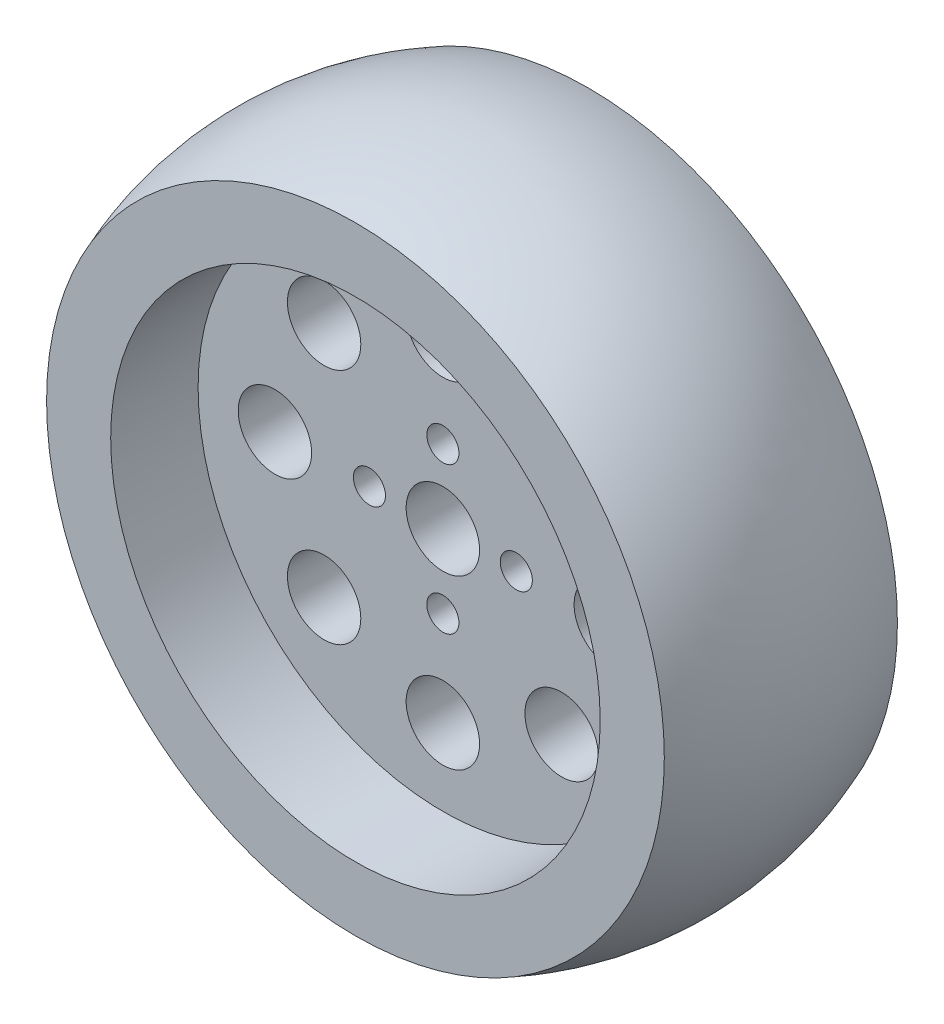
ISO-10303-21;
HEADER;
FILE_DESCRIPTION(('STEP AP214'),'2;1');
FILE_NAME('part.step','',(''),(''),'','','');
FILE_SCHEMA(('AUTOMOTIVE_DESIGN { 1 0 10303 214 1 1 1 1 }'));
ENDSEC;
DATA;
#1=APPLICATION_CONTEXT('core data for automotive mechanical design processes');
#2=APPLICATION_PROTOCOL_DEFINITION('international standard','automotive_design',2000,#1);
#3=PRODUCT_CONTEXT('',#1,'mechanical');
#4=PRODUCT('Part','Part','',(#3));
#5=PRODUCT_RELATED_PRODUCT_CATEGORY('part','',(#4));
#6=PRODUCT_DEFINITION_FORMATION('','',#4);
#7=PRODUCT_DEFINITION_CONTEXT('part definition',#1,'design');
#8=PRODUCT_DEFINITION('design','',#6,#7);
#9=PRODUCT_DEFINITION_SHAPE('','',#8);
#10=(LENGTH_UNIT() NAMED_UNIT(*) SI_UNIT(.MILLI.,.METRE.));
#11=(NAMED_UNIT(*) PLANE_ANGLE_UNIT() SI_UNIT($,.RADIAN.));
#12=(NAMED_UNIT(*) SI_UNIT($,.STERADIAN.) SOLID_ANGLE_UNIT());
#13=UNCERTAINTY_MEASURE_WITH_UNIT(LENGTH_MEASURE(1.E-05),#10,'distance_accuracy_value','');
#14=(GEOMETRIC_REPRESENTATION_CONTEXT(3) GLOBAL_UNCERTAINTY_ASSIGNED_CONTEXT((#13)) GLOBAL_UNIT_ASSIGNED_CONTEXT((#10,
#11,#12)) REPRESENTATION_CONTEXT('',''));
#15=CARTESIAN_POINT('',(0.,0.,0.));
#16=DIRECTION('',(0.,0.,1.));
#17=DIRECTION('',(1.,0.,0.));
#18=AXIS2_PLACEMENT_3D('',#15,#16,#17);
#19=CARTESIAN_POINT('',(0.,0.,2.159));
#20=DIRECTION('',(0.,0.,1.));
#21=DIRECTION('',(1.,0.,0.));
#22=AXIS2_PLACEMENT_3D('',#19,#20,#21);
#23=PLANE('',#22);
#24=CARTESIAN_POINT('',(0.,0.,2.159));
#25=DIRECTION('',(0.,0.,1.));
#26=DIRECTION('',(1.,0.,0.));
#27=AXIS2_PLACEMENT_3D('',#24,#25,#26);
#28=CIRCLE('',#27,26.67);
#29=CARTESIAN_POINT('',(26.67,0.,2.159));
#30=VERTEX_POINT('',#29);
#31=EDGE_CURVE('E41',#30,#30,#28,.T.);
#32=ORIENTED_EDGE('',*,*,#31,.F.);
#33=EDGE_LOOP('',(#32));
#34=FACE_BOUND('',#33,.T.);
#35=CARTESIAN_POINT('',(0.,0.,2.159));
#36=DIRECTION('',(0.,0.,-1.));
#37=DIRECTION('',(-1.,0.,0.));
#38=AXIS2_PLACEMENT_3D('',#35,#36,#37);
#39=CIRCLE('',#38,33.655);
#40=CARTESIAN_POINT('',(-33.655,0.,2.159));
#41=VERTEX_POINT('',#40);
#42=EDGE_CURVE('E48',#41,#41,#39,.T.);
#43=ORIENTED_EDGE('',*,*,#42,.F.);
#44=EDGE_LOOP('',(#43));
#45=FACE_BOUND('',#44,.T.);
#46=ADVANCED_FACE('F28',(#34,#45),#23,.T.);
#47=CARTESIAN_POINT('',(0.,0.,-7.366));
#48=DIRECTION('',(0.,0.,1.));
#49=DIRECTION('',(1.,0.,0.));
#50=AXIS2_PLACEMENT_3D('',#47,#48,#49);
#51=PLANE('',#50);
#52=CARTESIAN_POINT('',(-12.9400540957138,12.9400540957138,-7.366));
#53=DIRECTION('',(0.,0.,1.));
#54=DIRECTION('',(1.,0.,0.));
#55=AXIS2_PLACEMENT_3D('',#52,#53,#54);
#56=CIRCLE('',#55,4.);
#57=CARTESIAN_POINT('',(-8.94005409571382,12.9400540957138,-7.366));
#58=VERTEX_POINT('',#57);
#59=EDGE_CURVE('E101',#58,#58,#56,.T.);
#60=ORIENTED_EDGE('',*,*,#59,.F.);
#61=EDGE_LOOP('',(#60));
#62=FACE_BOUND('',#61,.T.);
#63=CARTESIAN_POINT('',(-12.9400540957138,-12.9400540957138,-7.366));
#64=DIRECTION('',(0.,0.,1.));
#65=DIRECTION('',(1.,0.,0.));
#66=AXIS2_PLACEMENT_3D('',#63,#64,#65);
#67=CIRCLE('',#66,4.);
#68=CARTESIAN_POINT('',(-8.94005409571382,-12.9400540957138,-7.366));
#69=VERTEX_POINT('',#68);
#70=EDGE_CURVE('E91',#69,#69,#67,.T.);
#71=ORIENTED_EDGE('',*,*,#70,.F.);
#72=EDGE_LOOP('',(#71));
#73=FACE_BOUND('',#72,.T.);
#74=CARTESIAN_POINT('',(12.9400540957138,-12.9400540957138,-7.366));
#75=DIRECTION('',(0.,0.,1.));
#76=DIRECTION('',(1.,0.,0.));
#77=AXIS2_PLACEMENT_3D('',#74,#75,#76);
#78=CIRCLE('',#77,4.);
#79=CARTESIAN_POINT('',(16.9400540957138,-12.9400540957138,-7.366));
#80=VERTEX_POINT('',#79);
#81=EDGE_CURVE('E88',#80,#80,#78,.T.);
#82=ORIENTED_EDGE('',*,*,#81,.F.);
#83=EDGE_LOOP('',(#82));
#84=FACE_BOUND('',#83,.T.);
#85=CARTESIAN_POINT('',(12.9400540957138,12.9400540957138,-7.366));
#86=DIRECTION('',(0.,0.,1.));
#87=DIRECTION('',(1.,0.,0.));
#88=AXIS2_PLACEMENT_3D('',#85,#86,#87);
#89=CIRCLE('',#88,4.);
#90=CARTESIAN_POINT('',(16.9400540957138,12.9400540957138,-7.366));
#91=VERTEX_POINT('',#90);
#92=EDGE_CURVE('E85',#91,#91,#89,.T.);
#93=ORIENTED_EDGE('',*,*,#92,.F.);
#94=EDGE_LOOP('',(#93));
#95=FACE_BOUND('',#94,.T.);
#96=CARTESIAN_POINT('',(-18.3,0.,-7.366));
#97=DIRECTION('',(0.,0.,1.));
#98=DIRECTION('',(1.,0.,0.));
#99=AXIS2_PLACEMENT_3D('',#96,#97,#98);
#100=CIRCLE('',#99,4.);
#101=CARTESIAN_POINT('',(-14.3,0.,-7.366));
#102=VERTEX_POINT('',#101);
#103=EDGE_CURVE('E81',#102,#102,#100,.T.);
#104=ORIENTED_EDGE('',*,*,#103,.F.);
#105=EDGE_LOOP('',(#104));
#106=FACE_BOUND('',#105,.T.);
#107=CARTESIAN_POINT('',(0.,-18.3,-7.366));
#108=DIRECTION('',(0.,0.,1.));
#109=DIRECTION('',(1.,0.,0.));
#110=AXIS2_PLACEMENT_3D('',#107,#108,#109);
#111=CIRCLE('',#110,4.);
#112=CARTESIAN_POINT('',(4.,-18.3,-7.366));
#113=VERTEX_POINT('',#112);
#114=EDGE_CURVE('E77',#113,#113,#111,.T.);
#115=ORIENTED_EDGE('',*,*,#114,.F.);
#116=EDGE_LOOP('',(#115));
#117=FACE_BOUND('',#116,.T.);
#118=CARTESIAN_POINT('',(18.3,0.,-7.366));
#119=DIRECTION('',(0.,0.,1.));
#120=DIRECTION('',(1.,0.,0.));
#121=AXIS2_PLACEMENT_3D('',#118,#119,#120);
#122=CIRCLE('',#121,4.);
#123=CARTESIAN_POINT('',(22.3,0.,-7.366));
#124=VERTEX_POINT('',#123);
#125=EDGE_CURVE('E73',#124,#124,#122,.T.);
#126=ORIENTED_EDGE('',*,*,#125,.F.);
#127=EDGE_LOOP('',(#126));
#128=FACE_BOUND('',#127,.T.);
#129=CARTESIAN_POINT('',(0.,18.3,-7.366));
#130=DIRECTION('',(0.,0.,1.));
#131=DIRECTION('',(1.,0.,0.));
#132=AXIS2_PLACEMENT_3D('',#129,#130,#131);
#133=CIRCLE('',#132,4.);
#134=CARTESIAN_POINT('',(4.,18.3,-7.366));
#135=VERTEX_POINT('',#134);
#136=EDGE_CURVE('E69',#135,#135,#133,.T.);
#137=ORIENTED_EDGE('',*,*,#136,.F.);
#138=EDGE_LOOP('',(#137));
#139=FACE_BOUND('',#138,.T.);
#140=CARTESIAN_POINT('',(-8.,0.,-7.366));
#141=DIRECTION('',(0.,0.,1.));
#142=DIRECTION('',(1.,0.,0.));
#143=AXIS2_PLACEMENT_3D('',#140,#141,#142);
#144=CIRCLE('',#143,1.75);
#145=CARTESIAN_POINT('',(-6.25,0.,-7.366));
#146=VERTEX_POINT('',#145);
#147=EDGE_CURVE('E65',#146,#146,#144,.T.);
#148=ORIENTED_EDGE('',*,*,#147,.F.);
#149=EDGE_LOOP('',(#148));
#150=FACE_BOUND('',#149,.T.);
#151=CARTESIAN_POINT('',(0.,-8.,-7.366));
#152=DIRECTION('',(0.,0.,1.));
#153=DIRECTION('',(1.,0.,0.));
#154=AXIS2_PLACEMENT_3D('',#151,#152,#153);
#155=CIRCLE('',#154,1.75);
#156=CARTESIAN_POINT('',(1.75,-8.,-7.366));
#157=VERTEX_POINT('',#156);
#158=EDGE_CURVE('E61',#157,#157,#155,.T.);
#159=ORIENTED_EDGE('',*,*,#158,.F.);
#160=EDGE_LOOP('',(#159));
#161=FACE_BOUND('',#160,.T.);
#162=CARTESIAN_POINT('',(8.,0.,-7.366));
#163=DIRECTION('',(0.,0.,1.));
#164=DIRECTION('',(1.,0.,0.));
#165=AXIS2_PLACEMENT_3D('',#162,#163,#164);
#166=CIRCLE('',#165,1.75);
#167=CARTESIAN_POINT('',(9.75,0.,-7.366));
#168=VERTEX_POINT('',#167);
#169=EDGE_CURVE('E57',#168,#168,#166,.T.);
#170=ORIENTED_EDGE('',*,*,#169,.F.);
#171=EDGE_LOOP('',(#170));
#172=FACE_BOUND('',#171,.T.);
#173=CARTESIAN_POINT('',(0.,8.,-7.366));
#174=DIRECTION('',(0.,0.,1.));
#175=DIRECTION('',(1.,0.,0.));
#176=AXIS2_PLACEMENT_3D('',#173,#174,#175);
#177=CIRCLE('',#176,1.75);
#178=CARTESIAN_POINT('',(1.75,8.,-7.366));
#179=VERTEX_POINT('',#178);
#180=EDGE_CURVE('E53',#179,#179,#177,.T.);
#181=ORIENTED_EDGE('',*,*,#180,.F.);
#182=EDGE_LOOP('',(#181));
#183=FACE_BOUND('',#182,.T.);
#184=CARTESIAN_POINT('',(0.,0.,-7.366));
#185=DIRECTION('',(0.,0.,1.));
#186=DIRECTION('',(1.,0.,0.));
#187=AXIS2_PLACEMENT_3D('',#184,#185,#186);
#188=CIRCLE('',#187,4.);
#189=CARTESIAN_POINT('',(4.,0.,-7.366));
#190=VERTEX_POINT('',#189);
#191=EDGE_CURVE('E49',#190,#190,#188,.T.);
#192=ORIENTED_EDGE('',*,*,#191,.F.);
#193=EDGE_LOOP('',(#192));
#194=FACE_BOUND('',#193,.T.);
#195=CARTESIAN_POINT('',(0.,0.,-7.366));
#196=DIRECTION('',(0.,0.,1.));
#197=DIRECTION('',(1.,0.,0.));
#198=AXIS2_PLACEMENT_3D('',#195,#196,#197);
#199=CIRCLE('',#198,26.67);
#200=CARTESIAN_POINT('',(26.67,0.,-7.366));
#201=VERTEX_POINT('',#200);
#202=EDGE_CURVE('E10',#201,#201,#199,.T.);
#203=ORIENTED_EDGE('',*,*,#202,.T.);
#204=EDGE_LOOP('',(#203));
#205=FACE_BOUND('',#204,.T.);
#206=ADVANCED_FACE('F137',(#62,#73,#84,#95,#106,#117,#128,#139,#150,#161,#172,#183,#194,#205),
#51,.T.);
#207=CARTESIAN_POINT('',(0.,0.,-7.366));
#208=DIRECTION('',(0.,0.,1.));
#209=DIRECTION('',(1.,0.,0.));
#210=AXIS2_PLACEMENT_3D('',#207,#208,#209);
#211=CYLINDRICAL_SURFACE('',#210,26.67);
#212=ORIENTED_EDGE('',*,*,#202,.F.);
#213=EDGE_LOOP('',(#212));
#214=FACE_BOUND('',#213,.T.);
#215=ORIENTED_EDGE('',*,*,#31,.T.);
#216=EDGE_LOOP('',(#215));
#217=FACE_BOUND('',#216,.T.);
#218=ADVANCED_FACE('F30',(#214,#217),#211,.F.);
#219=CARTESIAN_POINT('',(0.,0.,-10.541));
#220=DIRECTION('',(0.,0.,-1.));
#221=DIRECTION('',(-1.,0.,0.));
#222=AXIS2_PLACEMENT_3D('',#219,#220,#221);
#223=DEGENERATE_TOROIDAL_SURFACE('',#222,1.8774674519895,34.2213613820355,.T.);
#224=CARTESIAN_POINT('',(0.,0.,-23.241));
#225=DIRECTION('',(0.,0.,-1.));
#226=DIRECTION('',(-1.,0.,0.));
#227=AXIS2_PLACEMENT_3D('',#224,#225,#226);
#228=CIRCLE('',#227,33.655);
#229=CARTESIAN_POINT('',(-33.655,0.,-23.241));
#230=VERTEX_POINT('',#229);
#231=EDGE_CURVE('E126',#230,#230,#228,.T.);
#232=ORIENTED_EDGE('',*,*,#231,.F.);
#233=EDGE_LOOP('',(#232));
#234=FACE_BOUND('',#233,.T.);
#235=ORIENTED_EDGE('',*,*,#42,.T.);
#236=EDGE_LOOP('',(#235));
#237=FACE_BOUND('',#236,.T.);
#238=ADVANCED_FACE('F141',(#234,#237),#223,.T.);
#239=CARTESIAN_POINT('',(0.,0.,-13.716));
#240=DIRECTION('',(0.,0.,-1.));
#241=DIRECTION('',(-1.,0.,0.));
#242=AXIS2_PLACEMENT_3D('',#239,#240,#241);
#243=PLANE('',#242);
#244=CARTESIAN_POINT('',(-12.9400540957138,12.9400540957138,-13.716));
#245=DIRECTION('',(0.,0.,-1.));
#246=DIRECTION('',(-1.,0.,0.));
#247=AXIS2_PLACEMENT_3D('',#244,#245,#246);
#248=CIRCLE('',#247,4.);
#249=CARTESIAN_POINT('',(-16.9400540957138,12.9400540957138,-13.716));
#250=VERTEX_POINT('',#249);
#251=EDGE_CURVE('E32',#250,#250,#248,.T.);
#252=ORIENTED_EDGE('',*,*,#251,.F.);
#253=EDGE_LOOP('',(#252));
#254=FACE_BOUND('',#253,.T.);
#255=CARTESIAN_POINT('',(-12.9400540957138,-12.9400540957138,-13.716));
#256=DIRECTION('',(0.,0.,-1.));
#257=DIRECTION('',(-1.,0.,0.));
#258=AXIS2_PLACEMENT_3D('',#255,#256,#257);
#259=CIRCLE('',#258,4.);
#260=CARTESIAN_POINT('',(-16.9400540957138,-12.9400540957138,-13.716));
#261=VERTEX_POINT('',#260);
#262=EDGE_CURVE('E89',#261,#261,#259,.T.);
#263=ORIENTED_EDGE('',*,*,#262,.F.);
#264=EDGE_LOOP('',(#263));
#265=FACE_BOUND('',#264,.T.);
#266=CARTESIAN_POINT('',(12.9400540957138,-12.9400540957138,-13.716));
#267=DIRECTION('',(0.,0.,-1.));
#268=DIRECTION('',(-1.,0.,0.));
#269=AXIS2_PLACEMENT_3D('',#266,#267,#268);
#270=CIRCLE('',#269,4.);
#271=CARTESIAN_POINT('',(8.94005409571382,-12.9400540957138,-13.716));
#272=VERTEX_POINT('',#271);
#273=EDGE_CURVE('E86',#272,#272,#270,.T.);
#274=ORIENTED_EDGE('',*,*,#273,.F.);
#275=EDGE_LOOP('',(#274));
#276=FACE_BOUND('',#275,.T.);
#277=CARTESIAN_POINT('',(12.9400540957138,12.9400540957138,-13.716));
#278=DIRECTION('',(0.,0.,-1.));
#279=DIRECTION('',(-1.,0.,0.));
#280=AXIS2_PLACEMENT_3D('',#277,#278,#279);
#281=CIRCLE('',#280,4.);
#282=CARTESIAN_POINT('',(8.94005409571382,12.9400540957138,-13.716));
#283=VERTEX_POINT('',#282);
#284=EDGE_CURVE('E82',#283,#283,#281,.T.);
#285=ORIENTED_EDGE('',*,*,#284,.F.);
#286=EDGE_LOOP('',(#285));
#287=FACE_BOUND('',#286,.T.);
#288=CARTESIAN_POINT('',(-18.3,0.,-13.716));
#289=DIRECTION('',(0.,0.,-1.));
#290=DIRECTION('',(-1.,0.,0.));
#291=AXIS2_PLACEMENT_3D('',#288,#289,#290);
#292=CIRCLE('',#291,4.);
#293=CARTESIAN_POINT('',(-22.3,0.,-13.716));
#294=VERTEX_POINT('',#293);
#295=EDGE_CURVE('E78',#294,#294,#292,.T.);
#296=ORIENTED_EDGE('',*,*,#295,.F.);
#297=EDGE_LOOP('',(#296));
#298=FACE_BOUND('',#297,.T.);
#299=CARTESIAN_POINT('',(0.,-18.3,-13.716));
#300=DIRECTION('',(0.,0.,-1.));
#301=DIRECTION('',(-1.,0.,0.));
#302=AXIS2_PLACEMENT_3D('',#299,#300,#301);
#303=CIRCLE('',#302,4.);
#304=CARTESIAN_POINT('',(-4.,-18.3,-13.716));
#305=VERTEX_POINT('',#304);
#306=EDGE_CURVE('E74',#305,#305,#303,.T.);
#307=ORIENTED_EDGE('',*,*,#306,.F.);
#308=EDGE_LOOP('',(#307));
#309=FACE_BOUND('',#308,.T.);
#310=CARTESIAN_POINT('',(18.3,0.,-13.716));
#311=DIRECTION('',(0.,0.,-1.));
#312=DIRECTION('',(-1.,0.,0.));
#313=AXIS2_PLACEMENT_3D('',#310,#311,#312);
#314=CIRCLE('',#313,4.);
#315=CARTESIAN_POINT('',(14.3,0.,-13.716));
#316=VERTEX_POINT('',#315);
#317=EDGE_CURVE('E70',#316,#316,#314,.T.);
#318=ORIENTED_EDGE('',*,*,#317,.F.);
#319=EDGE_LOOP('',(#318));
#320=FACE_BOUND('',#319,.T.);
#321=CARTESIAN_POINT('',(0.,18.3,-13.716));
#322=DIRECTION('',(0.,0.,-1.));
#323=DIRECTION('',(-1.,0.,0.));
#324=AXIS2_PLACEMENT_3D('',#321,#322,#323);
#325=CIRCLE('',#324,4.);
#326=CARTESIAN_POINT('',(-4.,18.3,-13.716));
#327=VERTEX_POINT('',#326);
#328=EDGE_CURVE('E66',#327,#327,#325,.T.);
#329=ORIENTED_EDGE('',*,*,#328,.F.);
#330=EDGE_LOOP('',(#329));
#331=FACE_BOUND('',#330,.T.);
#332=CARTESIAN_POINT('',(-8.,0.,-13.716));
#333=DIRECTION('',(0.,0.,-1.));
#334=DIRECTION('',(-1.,0.,0.));
#335=AXIS2_PLACEMENT_3D('',#332,#333,#334);
#336=CIRCLE('',#335,1.75);
#337=CARTESIAN_POINT('',(-9.75,0.,-13.716));
#338=VERTEX_POINT('',#337);
#339=EDGE_CURVE('E62',#338,#338,#336,.T.);
#340=ORIENTED_EDGE('',*,*,#339,.F.);
#341=EDGE_LOOP('',(#340));
#342=FACE_BOUND('',#341,.T.);
#343=CARTESIAN_POINT('',(0.,-8.,-13.716));
#344=DIRECTION('',(0.,0.,-1.));
#345=DIRECTION('',(-1.,0.,0.));
#346=AXIS2_PLACEMENT_3D('',#343,#344,#345);
#347=CIRCLE('',#346,1.75);
#348=CARTESIAN_POINT('',(-1.75,-8.,-13.716));
#349=VERTEX_POINT('',#348);
#350=EDGE_CURVE('E58',#349,#349,#347,.T.);
#351=ORIENTED_EDGE('',*,*,#350,.F.);
#352=EDGE_LOOP('',(#351));
#353=FACE_BOUND('',#352,.T.);
#354=CARTESIAN_POINT('',(8.,0.,-13.716));
#355=DIRECTION('',(0.,0.,-1.));
#356=DIRECTION('',(-1.,0.,0.));
#357=AXIS2_PLACEMENT_3D('',#354,#355,#356);
#358=CIRCLE('',#357,1.75);
#359=CARTESIAN_POINT('',(6.25,0.,-13.716));
#360=VERTEX_POINT('',#359);
#361=EDGE_CURVE('E54',#360,#360,#358,.T.);
#362=ORIENTED_EDGE('',*,*,#361,.F.);
#363=EDGE_LOOP('',(#362));
#364=FACE_BOUND('',#363,.T.);
#365=CARTESIAN_POINT('',(0.,8.,-13.716));
#366=DIRECTION('',(0.,0.,-1.));
#367=DIRECTION('',(-1.,0.,0.));
#368=AXIS2_PLACEMENT_3D('',#365,#366,#367);
#369=CIRCLE('',#368,1.75);
#370=CARTESIAN_POINT('',(-1.75,8.,-13.716));
#371=VERTEX_POINT('',#370);
#372=EDGE_CURVE('E50',#371,#371,#369,.T.);
#373=ORIENTED_EDGE('',*,*,#372,.F.);
#374=EDGE_LOOP('',(#373));
#375=FACE_BOUND('',#374,.T.);
#376=CARTESIAN_POINT('',(0.,0.,-13.716));
#377=DIRECTION('',(0.,0.,-1.));
#378=DIRECTION('',(-1.,0.,0.));
#379=AXIS2_PLACEMENT_3D('',#376,#377,#378);
#380=CIRCLE('',#379,4.);
#381=CARTESIAN_POINT('',(-4.,0.,-13.716));
#382=VERTEX_POINT('',#381);
#383=EDGE_CURVE('E45',#382,#382,#380,.T.);
#384=ORIENTED_EDGE('',*,*,#383,.F.);
#385=EDGE_LOOP('',(#384));
#386=FACE_BOUND('',#385,.T.);
#387=CARTESIAN_POINT('',(0.,0.,-13.716));
#388=DIRECTION('',(0.,0.,-1.));
#389=DIRECTION('',(-1.,0.,0.));
#390=AXIS2_PLACEMENT_3D('',#387,#388,#389);
#391=CIRCLE('',#390,26.67);
#392=CARTESIAN_POINT('',(-26.67,0.,-13.716));
#393=VERTEX_POINT('',#392);
#394=EDGE_CURVE('E36',#393,#393,#391,.T.);
#395=ORIENTED_EDGE('',*,*,#394,.T.);
#396=EDGE_LOOP('',(#395));
#397=FACE_BOUND('',#396,.T.);
#398=ADVANCED_FACE('F143',(#254,#265,#276,#287,#298,#309,#320,#331,#342,#353,#364,#375,#386,
#397),#243,.T.);
#399=CARTESIAN_POINT('',(0.,0.,-13.716));
#400=DIRECTION('',(0.,0.,-1.));
#401=DIRECTION('',(-1.,0.,0.));
#402=AXIS2_PLACEMENT_3D('',#399,#400,#401);
#403=CYLINDRICAL_SURFACE('',#402,26.67);
#404=ORIENTED_EDGE('',*,*,#394,.F.);
#405=EDGE_LOOP('',(#404));
#406=FACE_BOUND('',#405,.T.);
#407=CARTESIAN_POINT('',(0.,0.,-23.241));
#408=DIRECTION('',(0.,0.,-1.));
#409=DIRECTION('',(-1.,0.,0.));
#410=AXIS2_PLACEMENT_3D('',#407,#408,#409);
#411=CIRCLE('',#410,26.67);
#412=CARTESIAN_POINT('',(-26.67,0.,-23.241));
#413=VERTEX_POINT('',#412);
#414=EDGE_CURVE('E129',#413,#413,#411,.T.);
#415=ORIENTED_EDGE('',*,*,#414,.T.);
#416=EDGE_LOOP('',(#415));
#417=FACE_BOUND('',#416,.T.);
#418=ADVANCED_FACE('F150',(#406,#417),#403,.F.);
#419=CARTESIAN_POINT('',(0.,0.,-23.241));
#420=DIRECTION('',(0.,0.,-1.));
#421=DIRECTION('',(-1.,0.,0.));
#422=AXIS2_PLACEMENT_3D('',#419,#420,#421);
#423=PLANE('',#422);
#424=ORIENTED_EDGE('',*,*,#414,.F.);
#425=EDGE_LOOP('',(#424));
#426=FACE_BOUND('',#425,.T.);
#427=ORIENTED_EDGE('',*,*,#231,.T.);
#428=EDGE_LOOP('',(#427));
#429=FACE_BOUND('',#428,.T.);
#430=ADVANCED_FACE('F159',(#426,#429),#423,.T.);
#431=CARTESIAN_POINT('',(0.,0.,-23.241));
#432=DIRECTION('',(0.,0.,1.));
#433=DIRECTION('',(1.,0.,0.));
#434=AXIS2_PLACEMENT_3D('',#431,#432,#433);
#435=CYLINDRICAL_SURFACE('',#434,4.);
#436=ORIENTED_EDGE('',*,*,#383,.T.);
#437=EDGE_LOOP('',(#436));
#438=FACE_BOUND('',#437,.T.);
#439=ORIENTED_EDGE('',*,*,#191,.T.);
#440=EDGE_LOOP('',(#439));
#441=FACE_BOUND('',#440,.T.);
#442=ADVANCED_FACE('F157',(#438,#441),#435,.F.);
#443=CARTESIAN_POINT('',(0.,8.,-23.241));
#444=DIRECTION('',(0.,0.,1.));
#445=DIRECTION('',(1.,0.,0.));
#446=AXIS2_PLACEMENT_3D('',#443,#444,#445);
#447=CYLINDRICAL_SURFACE('',#446,1.75);
#448=ORIENTED_EDGE('',*,*,#372,.T.);
#449=EDGE_LOOP('',(#448));
#450=FACE_BOUND('',#449,.T.);
#451=ORIENTED_EDGE('',*,*,#180,.T.);
#452=EDGE_LOOP('',(#451));
#453=FACE_BOUND('',#452,.T.);
#454=ADVANCED_FACE('F196',(#450,#453),#447,.F.);
#455=CARTESIAN_POINT('',(8.,0.,-23.241));
#456=DIRECTION('',(0.,0.,1.));
#457=DIRECTION('',(1.,0.,0.));
#458=AXIS2_PLACEMENT_3D('',#455,#456,#457);
#459=CYLINDRICAL_SURFACE('',#458,1.75);
#460=ORIENTED_EDGE('',*,*,#361,.T.);
#461=EDGE_LOOP('',(#460));
#462=FACE_BOUND('',#461,.T.);
#463=ORIENTED_EDGE('',*,*,#169,.T.);
#464=EDGE_LOOP('',(#463));
#465=FACE_BOUND('',#464,.T.);
#466=ADVANCED_FACE('F201',(#462,#465),#459,.F.);
#467=CARTESIAN_POINT('',(0.,-8.,-23.241));
#468=DIRECTION('',(0.,0.,1.));
#469=DIRECTION('',(1.,0.,0.));
#470=AXIS2_PLACEMENT_3D('',#467,#468,#469);
#471=CYLINDRICAL_SURFACE('',#470,1.75);
#472=ORIENTED_EDGE('',*,*,#350,.T.);
#473=EDGE_LOOP('',(#472));
#474=FACE_BOUND('',#473,.T.);
#475=ORIENTED_EDGE('',*,*,#158,.T.);
#476=EDGE_LOOP('',(#475));
#477=FACE_BOUND('',#476,.T.);
#478=ADVANCED_FACE('F213',(#474,#477),#471,.F.);
#479=CARTESIAN_POINT('',(-8.,0.,-23.241));
#480=DIRECTION('',(0.,0.,1.));
#481=DIRECTION('',(1.,0.,0.));
#482=AXIS2_PLACEMENT_3D('',#479,#480,#481);
#483=CYLINDRICAL_SURFACE('',#482,1.75);
#484=ORIENTED_EDGE('',*,*,#339,.T.);
#485=EDGE_LOOP('',(#484));
#486=FACE_BOUND('',#485,.T.);
#487=ORIENTED_EDGE('',*,*,#147,.T.);
#488=EDGE_LOOP('',(#487));
#489=FACE_BOUND('',#488,.T.);
#490=ADVANCED_FACE('F220',(#486,#489),#483,.F.);
#491=CARTESIAN_POINT('',(0.,18.3,-23.241));
#492=DIRECTION('',(0.,0.,1.));
#493=DIRECTION('',(1.,0.,0.));
#494=AXIS2_PLACEMENT_3D('',#491,#492,#493);
#495=CYLINDRICAL_SURFACE('',#494,4.);
#496=ORIENTED_EDGE('',*,*,#328,.T.);
#497=EDGE_LOOP('',(#496));
#498=FACE_BOUND('',#497,.T.);
#499=ORIENTED_EDGE('',*,*,#136,.T.);
#500=EDGE_LOOP('',(#499));
#501=FACE_BOUND('',#500,.T.);
#502=ADVANCED_FACE('F224',(#498,#501),#495,.F.);
#503=CARTESIAN_POINT('',(18.3,0.,-23.241));
#504=DIRECTION('',(0.,0.,1.));
#505=DIRECTION('',(1.,0.,0.));
#506=AXIS2_PLACEMENT_3D('',#503,#504,#505);
#507=CYLINDRICAL_SURFACE('',#506,4.);
#508=ORIENTED_EDGE('',*,*,#317,.T.);
#509=EDGE_LOOP('',(#508));
#510=FACE_BOUND('',#509,.T.);
#511=ORIENTED_EDGE('',*,*,#125,.T.);
#512=EDGE_LOOP('',(#511));
#513=FACE_BOUND('',#512,.T.);
#514=ADVANCED_FACE('F228',(#510,#513),#507,.F.);
#515=CARTESIAN_POINT('',(0.,-18.3,-23.241));
#516=DIRECTION('',(0.,0.,1.));
#517=DIRECTION('',(1.,0.,0.));
#518=AXIS2_PLACEMENT_3D('',#515,#516,#517);
#519=CYLINDRICAL_SURFACE('',#518,4.);
#520=ORIENTED_EDGE('',*,*,#306,.T.);
#521=EDGE_LOOP('',(#520));
#522=FACE_BOUND('',#521,.T.);
#523=ORIENTED_EDGE('',*,*,#114,.T.);
#524=EDGE_LOOP('',(#523));
#525=FACE_BOUND('',#524,.T.);
#526=ADVANCED_FACE('F232',(#522,#525),#519,.F.);
#527=CARTESIAN_POINT('',(-18.3,0.,-23.241));
#528=DIRECTION('',(0.,0.,1.));
#529=DIRECTION('',(1.,0.,0.));
#530=AXIS2_PLACEMENT_3D('',#527,#528,#529);
#531=CYLINDRICAL_SURFACE('',#530,4.);
#532=ORIENTED_EDGE('',*,*,#295,.T.);
#533=EDGE_LOOP('',(#532));
#534=FACE_BOUND('',#533,.T.);
#535=ORIENTED_EDGE('',*,*,#103,.T.);
#536=EDGE_LOOP('',(#535));
#537=FACE_BOUND('',#536,.T.);
#538=ADVANCED_FACE('F236',(#534,#537),#531,.F.);
#539=CARTESIAN_POINT('',(12.9400540957138,12.9400540957138,-23.241));
#540=DIRECTION('',(0.,0.,1.));
#541=DIRECTION('',(1.,0.,0.));
#542=AXIS2_PLACEMENT_3D('',#539,#540,#541);
#543=CYLINDRICAL_SURFACE('',#542,4.);
#544=ORIENTED_EDGE('',*,*,#284,.T.);
#545=EDGE_LOOP('',(#544));
#546=FACE_BOUND('',#545,.T.);
#547=ORIENTED_EDGE('',*,*,#92,.T.);
#548=EDGE_LOOP('',(#547));
#549=FACE_BOUND('',#548,.T.);
#550=ADVANCED_FACE('F240',(#546,#549),#543,.F.);
#551=CARTESIAN_POINT('',(12.9400540957138,-12.9400540957138,-23.241));
#552=DIRECTION('',(0.,0.,1.));
#553=DIRECTION('',(1.,0.,0.));
#554=AXIS2_PLACEMENT_3D('',#551,#552,#553);
#555=CYLINDRICAL_SURFACE('',#554,4.);
#556=ORIENTED_EDGE('',*,*,#273,.T.);
#557=EDGE_LOOP('',(#556));
#558=FACE_BOUND('',#557,.T.);
#559=ORIENTED_EDGE('',*,*,#81,.T.);
#560=EDGE_LOOP('',(#559));
#561=FACE_BOUND('',#560,.T.);
#562=ADVANCED_FACE('F244',(#558,#561),#555,.F.);
#563=CARTESIAN_POINT('',(-12.9400540957138,-12.9400540957138,-23.241));
#564=DIRECTION('',(0.,0.,1.));
#565=DIRECTION('',(1.,0.,0.));
#566=AXIS2_PLACEMENT_3D('',#563,#564,#565);
#567=CYLINDRICAL_SURFACE('',#566,4.);
#568=ORIENTED_EDGE('',*,*,#262,.T.);
#569=EDGE_LOOP('',(#568));
#570=FACE_BOUND('',#569,.T.);
#571=ORIENTED_EDGE('',*,*,#70,.T.);
#572=EDGE_LOOP('',(#571));
#573=FACE_BOUND('',#572,.T.);
#574=ADVANCED_FACE('F248',(#570,#573),#567,.F.);
#575=CARTESIAN_POINT('',(-12.9400540957138,12.9400540957138,-23.241));
#576=DIRECTION('',(0.,0.,1.));
#577=DIRECTION('',(1.,0.,0.));
#578=AXIS2_PLACEMENT_3D('',#575,#576,#577);
#579=CYLINDRICAL_SURFACE('',#578,4.);
#580=ORIENTED_EDGE('',*,*,#251,.T.);
#581=EDGE_LOOP('',(#580));
#582=FACE_BOUND('',#581,.T.);
#583=ORIENTED_EDGE('',*,*,#59,.T.);
#584=EDGE_LOOP('',(#583));
#585=FACE_BOUND('',#584,.T.);
#586=ADVANCED_FACE('F252',(#582,#585),#579,.F.);
#587=CLOSED_SHELL('',(#46,#206,#218,#238,#398,#418,#430,#442,#454,#466,#478,#490,#502,#514,#526,
#538,#550,#562,#574,#586));
#588=MANIFOLD_SOLID_BREP('B2',#587);
#589=ADVANCED_BREP_SHAPE_REPRESENTATION('',(#18,#588),#14);
#590=SHAPE_DEFINITION_REPRESENTATION(#9,#589);
ENDSEC;
END-ISO-10303-21;
